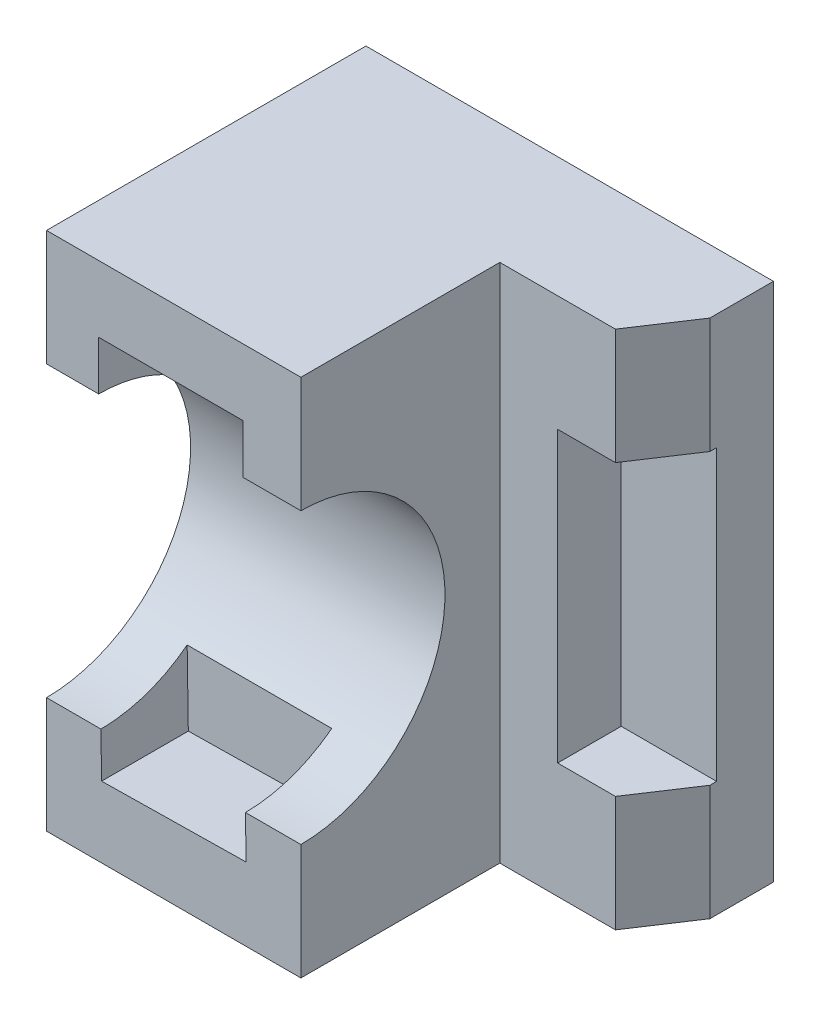
ISO-10303-21;
HEADER;
FILE_DESCRIPTION(('STEP AP214'),'2;1');
FILE_NAME('part.step','',(''),(''),'','','');
FILE_SCHEMA(('AUTOMOTIVE_DESIGN { 1 0 10303 214 1 1 1 1 }'));
ENDSEC;
DATA;
#1=APPLICATION_CONTEXT('core data for automotive mechanical design processes');
#2=APPLICATION_PROTOCOL_DEFINITION('international standard','automotive_design',2000,#1);
#3=PRODUCT_CONTEXT('',#1,'mechanical');
#4=PRODUCT('Part','Part','',(#3));
#5=PRODUCT_RELATED_PRODUCT_CATEGORY('part','',(#4));
#6=PRODUCT_DEFINITION_FORMATION('','',#4);
#7=PRODUCT_DEFINITION_CONTEXT('part definition',#1,'design');
#8=PRODUCT_DEFINITION('design','',#6,#7);
#9=PRODUCT_DEFINITION_SHAPE('','',#8);
#10=(LENGTH_UNIT() NAMED_UNIT(*) SI_UNIT(.MILLI.,.METRE.));
#11=(NAMED_UNIT(*) PLANE_ANGLE_UNIT() SI_UNIT($,.RADIAN.));
#12=(NAMED_UNIT(*) SI_UNIT($,.STERADIAN.) SOLID_ANGLE_UNIT());
#13=UNCERTAINTY_MEASURE_WITH_UNIT(LENGTH_MEASURE(1.E-05),#10,'distance_accuracy_value','');
#14=(GEOMETRIC_REPRESENTATION_CONTEXT(3) GLOBAL_UNCERTAINTY_ASSIGNED_CONTEXT((#13)) GLOBAL_UNIT_ASSIGNED_CONTEXT((#10,
#11,#12)) REPRESENTATION_CONTEXT('',''));
#15=CARTESIAN_POINT('',(0.,0.,0.));
#16=DIRECTION('',(0.,0.,1.));
#17=DIRECTION('',(1.,0.,0.));
#18=AXIS2_PLACEMENT_3D('',#15,#16,#17);
#19=CARTESIAN_POINT('',(35.25,45.,55.25));
#20=DIRECTION('',(-1.,0.,0.));
#21=DIRECTION('',(0.,-1.,0.));
#22=AXIS2_PLACEMENT_3D('',#19,#20,#21);
#23=PLANE('',#22);
#24=DIRECTION('',(0.,0.,-1.));
#25=VECTOR('',#24,1.);
#26=CARTESIAN_POINT('',(35.25,25.,55.25));
#27=LINE('',#26,#25);
#28=CARTESIAN_POINT('',(35.25,25.,11.));
#29=VERTEX_POINT('',#28);
#30=CARTESIAN_POINT('',(35.25,25.,9.83528129668615));
#31=VERTEX_POINT('',#30);
#32=EDGE_CURVE('E249',#29,#31,#27,.T.);
#33=ORIENTED_EDGE('',*,*,#32,.T.);
#34=DIRECTION('',(0.,1.,0.));
#35=VECTOR('',#34,1.);
#36=CARTESIAN_POINT('',(35.25,25.,9.83528129668615));
#37=LINE('',#36,#35);
#38=CARTESIAN_POINT('',(35.25,-25.,9.83528129668615));
#39=VERTEX_POINT('',#38);
#40=EDGE_CURVE('E214',#39,#31,#37,.T.);
#41=ORIENTED_EDGE('',*,*,#40,.F.);
#42=DIRECTION('',(0.,0.,-1.));
#43=VECTOR('',#42,1.);
#44=CARTESIAN_POINT('',(35.25,-25.,55.25));
#45=LINE('',#44,#43);
#46=CARTESIAN_POINT('',(35.25,-25.,11.));
#47=VERTEX_POINT('',#46);
#48=EDGE_CURVE('E243',#47,#39,#45,.T.);
#49=ORIENTED_EDGE('',*,*,#48,.F.);
#50=DIRECTION('',(0.,-1.,0.));
#51=VECTOR('',#50,1.);
#52=CARTESIAN_POINT('',(35.25,45.,11.));
#53=LINE('',#52,#51);
#54=CARTESIAN_POINT('',(35.25,-45.,11.));
#55=VERTEX_POINT('',#54);
#56=EDGE_CURVE('E293',#47,#55,#53,.T.);
#57=ORIENTED_EDGE('',*,*,#56,.T.);
#58=DIRECTION('',(0.,0.,-1.));
#59=VECTOR('',#58,1.);
#60=CARTESIAN_POINT('',(35.25,-45.,55.25));
#61=LINE('',#60,#59);
#62=CARTESIAN_POINT('',(35.25,-45.,0.));
#63=VERTEX_POINT('',#62);
#64=EDGE_CURVE('E309',#55,#63,#61,.T.);
#65=ORIENTED_EDGE('',*,*,#64,.T.);
#66=DIRECTION('',(0.,1.,0.));
#67=VECTOR('',#66,1.);
#68=CARTESIAN_POINT('',(35.25,45.,0.));
#69=LINE('',#68,#67);
#70=CARTESIAN_POINT('',(35.25,45.,0.));
#71=VERTEX_POINT('',#70);
#72=EDGE_CURVE('E288',#63,#71,#69,.T.);
#73=ORIENTED_EDGE('',*,*,#72,.T.);
#74=DIRECTION('',(0.,0.,-1.));
#75=VECTOR('',#74,1.);
#76=CARTESIAN_POINT('',(35.25,45.,55.25));
#77=LINE('',#76,#75);
#78=CARTESIAN_POINT('',(35.25,45.,11.));
#79=VERTEX_POINT('',#78);
#80=EDGE_CURVE('E325',#79,#71,#77,.T.);
#81=ORIENTED_EDGE('',*,*,#80,.F.);
#82=EDGE_CURVE('E290',#79,#29,#53,.T.);
#83=ORIENTED_EDGE('',*,*,#82,.T.);
#84=EDGE_LOOP('',(#33,#41,#49,#57,#65,#73,#81,#83));
#85=FACE_BOUND('',#84,.T.);
#86=ADVANCED_FACE('F37',(#85),#23,.F.);
#87=CARTESIAN_POINT('',(29.593975486219,45.,19.5582449406136));
#88=DIRECTION('',(0.834269415372969,0.,0.551357001019525));
#89=DIRECTION('',(0.551357001019525,0.,-0.834269415372969));
#90=AXIS2_PLACEMENT_3D('',#87,#88,#89);
#91=PLANE('',#90);
#92=DIRECTION('',(0.,-1.,0.));
#93=VECTOR('',#92,1.);
#94=CARTESIAN_POINT('',(28.75,45.,20.8352812966861));
#95=LINE('',#94,#93);
#96=CARTESIAN_POINT('',(28.75,45.,20.8352812966861));
#97=VERTEX_POINT('',#96);
#98=CARTESIAN_POINT('',(28.75,25.,20.8352812966861));
#99=VERTEX_POINT('',#98);
#100=EDGE_CURVE('E294',#97,#99,#95,.T.);
#101=ORIENTED_EDGE('',*,*,#100,.T.);
#102=DIRECTION('',(0.551357001019525,0.,-0.834269415372969));
#103=VECTOR('',#102,1.);
#104=CARTESIAN_POINT('',(29.593975486219,25.,19.5582449406136));
#105=LINE('',#104,#103);
#106=EDGE_CURVE('E255',#99,#29,#105,.T.);
#107=ORIENTED_EDGE('',*,*,#106,.T.);
#108=ORIENTED_EDGE('',*,*,#82,.F.);
#109=DIRECTION('',(-0.551357001019525,0.,0.834269415372969));
#110=VECTOR('',#109,1.);
#111=CARTESIAN_POINT('',(29.593975486219,45.,19.5582449406136));
#112=LINE('',#111,#110);
#113=EDGE_CURVE('E275',#79,#97,#112,.T.);
#114=ORIENTED_EDGE('',*,*,#113,.T.);
#115=EDGE_LOOP('',(#101,#107,#108,#114));
#116=FACE_BOUND('',#115,.T.);
#117=ADVANCED_FACE('F424',(#116),#91,.T.);
#118=ORIENTED_EDGE('',*,*,#56,.F.);
#119=DIRECTION('',(-0.551357001019525,0.,0.834269415372969));
#120=VECTOR('',#119,1.);
#121=CARTESIAN_POINT('',(29.593975486219,-25.,19.5582449406136));
#122=LINE('',#121,#120);
#123=CARTESIAN_POINT('',(28.75,-25.,20.8352812966861));
#124=VERTEX_POINT('',#123);
#125=EDGE_CURVE('E252',#47,#124,#122,.T.);
#126=ORIENTED_EDGE('',*,*,#125,.T.);
#127=CARTESIAN_POINT('',(28.75,-45.,20.8352812966861));
#128=VERTEX_POINT('',#127);
#129=EDGE_CURVE('E297',#124,#128,#95,.T.);
#130=ORIENTED_EDGE('',*,*,#129,.T.);
#131=DIRECTION('',(-0.551357001019525,0.,0.834269415372969));
#132=VECTOR('',#131,1.);
#133=CARTESIAN_POINT('',(29.593975486219,-45.,19.5582449406136));
#134=LINE('',#133,#132);
#135=EDGE_CURVE('E273',#55,#128,#134,.T.);
#136=ORIENTED_EDGE('',*,*,#135,.F.);
#137=EDGE_LOOP('',(#118,#126,#130,#136));
#138=FACE_BOUND('',#137,.T.);
#139=ADVANCED_FACE('F412',(#138),#91,.T.);
#140=CARTESIAN_POINT('',(0.,45.,20.8352812966861));
#141=DIRECTION('',(0.,0.,1.));
#142=DIRECTION('',(1.,0.,0.));
#143=AXIS2_PLACEMENT_3D('',#140,#141,#142);
#144=PLANE('',#143);
#145=DIRECTION('',(0.,1.,0.));
#146=VECTOR('',#145,1.);
#147=CARTESIAN_POINT('',(18.75,45.,20.8352812966861));
#148=LINE('',#147,#146);
#149=CARTESIAN_POINT('',(18.75,-25.,20.8352812966861));
#150=VERTEX_POINT('',#149);
#151=CARTESIAN_POINT('',(18.75,25.,20.8352812966862));
#152=VERTEX_POINT('',#151);
#153=EDGE_CURVE('E332',#150,#152,#148,.T.);
#154=ORIENTED_EDGE('',*,*,#153,.T.);
#155=DIRECTION('',(1.,0.,0.));
#156=VECTOR('',#155,1.);
#157=CARTESIAN_POINT('',(0.,25.,20.8352812966861));
#158=LINE('',#157,#156);
#159=EDGE_CURVE('E335',#152,#99,#158,.T.);
#160=ORIENTED_EDGE('',*,*,#159,.T.);
#161=ORIENTED_EDGE('',*,*,#100,.F.);
#162=DIRECTION('',(-1.,0.,0.));
#163=VECTOR('',#162,1.);
#164=CARTESIAN_POINT('',(0.,45.,20.8352812966861));
#165=LINE('',#164,#163);
#166=CARTESIAN_POINT('',(8.75000000000001,45.,20.8352812966861));
#167=VERTEX_POINT('',#166);
#168=EDGE_CURVE('E272',#97,#167,#165,.T.);
#169=ORIENTED_EDGE('',*,*,#168,.T.);
#170=DIRECTION('',(0.,-1.,0.));
#171=VECTOR('',#170,1.);
#172=CARTESIAN_POINT('',(8.75000000000001,45.,20.8352812966861));
#173=LINE('',#172,#171);
#174=CARTESIAN_POINT('',(8.75000000000001,-45.,20.8352812966861));
#175=VERTEX_POINT('',#174);
#176=EDGE_CURVE('E277',#167,#175,#173,.T.);
#177=ORIENTED_EDGE('',*,*,#176,.T.);
#178=DIRECTION('',(-1.,0.,0.));
#179=VECTOR('',#178,1.);
#180=CARTESIAN_POINT('',(0.,-45.,20.8352812966861));
#181=LINE('',#180,#179);
#182=EDGE_CURVE('E280',#128,#175,#181,.T.);
#183=ORIENTED_EDGE('',*,*,#182,.F.);
#184=ORIENTED_EDGE('',*,*,#129,.F.);
#185=DIRECTION('',(-1.,0.,0.));
#186=VECTOR('',#185,1.);
#187=CARTESIAN_POINT('',(0.,-25.,20.8352812966861));
#188=LINE('',#187,#186);
#189=EDGE_CURVE('E329',#124,#150,#188,.T.);
#190=ORIENTED_EDGE('',*,*,#189,.T.);
#191=EDGE_LOOP('',(#154,#160,#161,#169,#177,#183,#184,#190));
#192=FACE_BOUND('',#191,.T.);
#193=ADVANCED_FACE('F394',(#192),#144,.T.);
#194=CARTESIAN_POINT('',(0.,0.,55.25));
#195=DIRECTION('',(0.,0.,1.));
#196=DIRECTION('',(1.,0.,0.));
#197=AXIS2_PLACEMENT_3D('',#194,#195,#196);
#198=PLANE('',#197);
#199=DIRECTION('',(0.0153576422992211,-0.999882064457108,0.));
#200=VECTOR('',#199,1.);
#201=CARTESIAN_POINT('',(-25.7249479178134,-32.7489468110117,55.25));
#202=LINE('',#201,#200);
#203=CARTESIAN_POINT('',(-25.8439693545141,-24.9998797651539,55.25));
#204=VERTEX_POINT('',#203);
#205=CARTESIAN_POINT('',(-25.7249479178134,-32.7489468110117,55.25));
#206=VERTEX_POINT('',#205);
#207=EDGE_CURVE('E211',#204,#206,#202,.T.);
#208=ORIENTED_EDGE('',*,*,#207,.F.);
#209=DIRECTION('',(1.,0.,0.));
#210=VECTOR('',#209,1.);
#211=CARTESIAN_POINT('',(-35.25,-24.9998797651539,55.25));
#212=LINE('',#211,#210);
#213=CARTESIAN_POINT('',(-35.25,-24.9998797651539,55.25));
#214=VERTEX_POINT('',#213);
#215=EDGE_CURVE('E266',#214,#204,#212,.T.);
#216=ORIENTED_EDGE('',*,*,#215,.F.);
#217=DIRECTION('',(0.,-1.,0.));
#218=VECTOR('',#217,1.);
#219=CARTESIAN_POINT('',(-35.25,45.,55.25));
#220=LINE('',#219,#218);
#221=CARTESIAN_POINT('',(-35.25,-45.,55.25));
#222=VERTEX_POINT('',#221);
#223=EDGE_CURVE('E301',#214,#222,#220,.T.);
#224=ORIENTED_EDGE('',*,*,#223,.T.);
#225=DIRECTION('',(1.,0.,0.));
#226=VECTOR('',#225,1.);
#227=CARTESIAN_POINT('',(-35.25,-45.,55.25));
#228=LINE('',#227,#226);
#229=CARTESIAN_POINT('',(8.75000000000001,-45.,55.25));
#230=VERTEX_POINT('',#229);
#231=EDGE_CURVE('E306',#222,#230,#228,.T.);
#232=ORIENTED_EDGE('',*,*,#231,.T.);
#233=DIRECTION('',(0.,-1.,0.));
#234=VECTOR('',#233,1.);
#235=CARTESIAN_POINT('',(8.75000000000001,45.,55.25));
#236=LINE('',#235,#234);
#237=CARTESIAN_POINT('',(8.75000000000001,-24.9998797651539,55.25));
#238=VERTEX_POINT('',#237);
#239=EDGE_CURVE('E289',#238,#230,#236,.T.);
#240=ORIENTED_EDGE('',*,*,#239,.F.);
#241=CARTESIAN_POINT('',(-0.841020618180968,-24.9998797651539,55.25));
#242=VERTEX_POINT('',#241);
#243=EDGE_CURVE('E265',#242,#238,#212,.T.);
#244=ORIENTED_EDGE('',*,*,#243,.F.);
#245=DIRECTION('',(-0.015357642299222,0.999882064457108,0.));
#246=VECTOR('',#245,1.);
#247=CARTESIAN_POINT('',(-0.727896306385638,-32.3650057535312,55.25));
#248=LINE('',#247,#246);
#249=CARTESIAN_POINT('',(-0.727896306385638,-32.3650057535312,55.25));
#250=VERTEX_POINT('',#249);
#251=EDGE_CURVE('E221',#250,#242,#248,.T.);
#252=ORIENTED_EDGE('',*,*,#251,.F.);
#253=DIRECTION('',(0.999882064457108,0.0153576422992219,0.));
#254=VECTOR('',#253,1.);
#255=CARTESIAN_POINT('',(-25.7249479178134,-32.7489468110117,55.25));
#256=LINE('',#255,#254);
#257=EDGE_CURVE('E223',#206,#250,#256,.T.);
#258=ORIENTED_EDGE('',*,*,#257,.F.);
#259=EDGE_LOOP('',(#208,#216,#224,#232,#240,#244,#252,#258));
#260=FACE_BOUND('',#259,.T.);
#261=ADVANCED_FACE('F367',(#260),#198,.T.);
#262=CARTESIAN_POINT('',(-35.25,45.,55.25));
#263=DIRECTION('',(0.,-1.,0.));
#264=DIRECTION('',(0.,0.,-1.));
#265=AXIS2_PLACEMENT_3D('',#262,#263,#264);
#266=PLANE('',#265);
#267=DIRECTION('',(0.,0.,1.));
#268=VECTOR('',#267,1.);
#269=CARTESIAN_POINT('',(8.75000000000001,45.,0.));
#270=LINE('',#269,#268);
#271=CARTESIAN_POINT('',(8.75000000000001,45.,55.25));
#272=VERTEX_POINT('',#271);
#273=EDGE_CURVE('E270',#167,#272,#270,.T.);
#274=ORIENTED_EDGE('',*,*,#273,.F.);
#275=ORIENTED_EDGE('',*,*,#168,.F.);
#276=ORIENTED_EDGE('',*,*,#113,.F.);
#277=ORIENTED_EDGE('',*,*,#80,.T.);
#278=DIRECTION('',(-1.,0.,0.));
#279=VECTOR('',#278,1.);
#280=CARTESIAN_POINT('',(-35.25,45.,0.));
#281=LINE('',#280,#279);
#282=CARTESIAN_POINT('',(-35.25,45.,0.));
#283=VERTEX_POINT('',#282);
#284=EDGE_CURVE('E312',#71,#283,#281,.T.);
#285=ORIENTED_EDGE('',*,*,#284,.T.);
#286=DIRECTION('',(0.,0.,-1.));
#287=VECTOR('',#286,1.);
#288=CARTESIAN_POINT('',(-35.25,45.,55.25));
#289=LINE('',#288,#287);
#290=CARTESIAN_POINT('',(-35.25,45.,55.25));
#291=VERTEX_POINT('',#290);
#292=EDGE_CURVE('E322',#291,#283,#289,.T.);
#293=ORIENTED_EDGE('',*,*,#292,.F.);
#294=DIRECTION('',(-1.,0.,0.));
#295=VECTOR('',#294,1.);
#296=CARTESIAN_POINT('',(-35.25,45.,55.25));
#297=LINE('',#296,#295);
#298=EDGE_CURVE('E299',#272,#291,#297,.T.);
#299=ORIENTED_EDGE('',*,*,#298,.F.);
#300=EDGE_LOOP('',(#274,#275,#276,#277,#285,#293,#299));
#301=FACE_BOUND('',#300,.T.);
#302=ADVANCED_FACE('F399',(#301),#266,.F.);
#303=CARTESIAN_POINT('',(-35.25,-45.,55.25));
#304=DIRECTION('',(0.,1.,0.));
#305=DIRECTION('',(0.,0.,1.));
#306=AXIS2_PLACEMENT_3D('',#303,#304,#305);
#307=PLANE('',#306);
#308=DIRECTION('',(0.,0.,1.));
#309=VECTOR('',#308,1.);
#310=CARTESIAN_POINT('',(8.75000000000001,-45.,0.));
#311=LINE('',#310,#309);
#312=EDGE_CURVE('E269',#175,#230,#311,.T.);
#313=ORIENTED_EDGE('',*,*,#312,.T.);
#314=ORIENTED_EDGE('',*,*,#231,.F.);
#315=DIRECTION('',(0.,0.,-1.));
#316=VECTOR('',#315,1.);
#317=CARTESIAN_POINT('',(-35.25,-45.,55.25));
#318=LINE('',#317,#316);
#319=CARTESIAN_POINT('',(-35.25,-45.,0.));
#320=VERTEX_POINT('',#319);
#321=EDGE_CURVE('E319',#222,#320,#318,.T.);
#322=ORIENTED_EDGE('',*,*,#321,.T.);
#323=DIRECTION('',(1.,0.,0.));
#324=VECTOR('',#323,1.);
#325=CARTESIAN_POINT('',(-35.25,-45.,0.));
#326=LINE('',#325,#324);
#327=EDGE_CURVE('E302',#320,#63,#326,.T.);
#328=ORIENTED_EDGE('',*,*,#327,.T.);
#329=ORIENTED_EDGE('',*,*,#64,.F.);
#330=ORIENTED_EDGE('',*,*,#135,.T.);
#331=ORIENTED_EDGE('',*,*,#182,.T.);
#332=EDGE_LOOP('',(#313,#314,#322,#328,#329,#330,#331));
#333=FACE_BOUND('',#332,.T.);
#334=ADVANCED_FACE('F388',(#333),#307,.F.);
#335=DIRECTION('',(0.,1.,0.));
#336=VECTOR('',#335,1.);
#337=CARTESIAN_POINT('',(-1.23369173121415,33.5,55.25));
#338=LINE('',#337,#336);
#339=CARTESIAN_POINT('',(-1.23369173121414,24.9998797651539,55.25));
#340=VERTEX_POINT('',#339);
#341=CARTESIAN_POINT('',(-1.23369173121415,33.5,55.25));
#342=VERTEX_POINT('',#341);
#343=EDGE_CURVE('E199',#340,#342,#338,.T.);
#344=ORIENTED_EDGE('',*,*,#343,.F.);
#345=DIRECTION('',(1.,0.,0.));
#346=VECTOR('',#345,1.);
#347=CARTESIAN_POINT('',(-35.25,24.9998797651539,55.25));
#348=LINE('',#347,#346);
#349=CARTESIAN_POINT('',(8.75000000000001,24.9998797651539,55.25));
#350=VERTEX_POINT('',#349);
#351=EDGE_CURVE('E262',#350,#340,#348,.F.);
#352=ORIENTED_EDGE('',*,*,#351,.F.);
#353=EDGE_CURVE('E285',#272,#350,#236,.T.);
#354=ORIENTED_EDGE('',*,*,#353,.F.);
#355=ORIENTED_EDGE('',*,*,#298,.T.);
#356=CARTESIAN_POINT('',(-35.25,24.9998797651539,55.25));
#357=VERTEX_POINT('',#356);
#358=EDGE_CURVE('E303',#291,#357,#220,.T.);
#359=ORIENTED_EDGE('',*,*,#358,.T.);
#360=CARTESIAN_POINT('',(-26.2336917312141,24.9998797651539,55.25));
#361=VERTEX_POINT('',#360);
#362=EDGE_CURVE('E261',#361,#357,#348,.F.);
#363=ORIENTED_EDGE('',*,*,#362,.F.);
#364=DIRECTION('',(0.,-1.,0.));
#365=VECTOR('',#364,1.);
#366=CARTESIAN_POINT('',(-26.2336917312141,33.5,55.25));
#367=LINE('',#366,#365);
#368=CARTESIAN_POINT('',(-26.2336917312141,33.5,55.25));
#369=VERTEX_POINT('',#368);
#370=EDGE_CURVE('E193',#369,#361,#367,.T.);
#371=ORIENTED_EDGE('',*,*,#370,.F.);
#372=DIRECTION('',(-1.,0.,0.));
#373=VECTOR('',#372,1.);
#374=CARTESIAN_POINT('',(-26.2336917312141,33.5,55.25));
#375=LINE('',#374,#373);
#376=EDGE_CURVE('E210',#342,#369,#375,.T.);
#377=ORIENTED_EDGE('',*,*,#376,.F.);
#378=EDGE_LOOP('',(#344,#352,#354,#355,#359,#363,#371,#377));
#379=FACE_BOUND('',#378,.T.);
#380=ADVANCED_FACE('F354',(#379),#198,.T.);
#381=CARTESIAN_POINT('',(-35.25,45.,55.25));
#382=DIRECTION('',(1.,0.,0.));
#383=DIRECTION('',(0.,1.,0.));
#384=AXIS2_PLACEMENT_3D('',#381,#382,#383);
#385=PLANE('',#384);
#386=ORIENTED_EDGE('',*,*,#223,.F.);
#387=CARTESIAN_POINT('',(-35.25,0.,55.3275353329181));
#388=DIRECTION('',(1.,0.,0.));
#389=DIRECTION('',(0.,0.,-1.));
#390=AXIS2_PLACEMENT_3D('',#387,#388,#389);
#391=CIRCLE('',#390,25.);
#392=EDGE_CURVE('E258',#214,#357,#391,.T.);
#393=ORIENTED_EDGE('',*,*,#392,.T.);
#394=ORIENTED_EDGE('',*,*,#358,.F.);
#395=ORIENTED_EDGE('',*,*,#292,.T.);
#396=DIRECTION('',(0.,-1.,0.));
#397=VECTOR('',#396,1.);
#398=CARTESIAN_POINT('',(-35.25,45.,0.));
#399=LINE('',#398,#397);
#400=EDGE_CURVE('E314',#283,#320,#399,.T.);
#401=ORIENTED_EDGE('',*,*,#400,.T.);
#402=ORIENTED_EDGE('',*,*,#321,.F.);
#403=EDGE_LOOP('',(#386,#393,#394,#395,#401,#402));
#404=FACE_BOUND('',#403,.T.);
#405=ADVANCED_FACE('F361',(#404),#385,.F.);
#406=CARTESIAN_POINT('',(0.,0.,0.));
#407=DIRECTION('',(0.,0.,1.));
#408=DIRECTION('',(1.,0.,0.));
#409=AXIS2_PLACEMENT_3D('',#406,#407,#408);
#410=PLANE('',#409);
#411=ORIENTED_EDGE('',*,*,#72,.F.);
#412=ORIENTED_EDGE('',*,*,#327,.F.);
#413=ORIENTED_EDGE('',*,*,#400,.F.);
#414=ORIENTED_EDGE('',*,*,#284,.F.);
#415=EDGE_LOOP('',(#411,#412,#413,#414));
#416=FACE_BOUND('',#415,.T.);
#417=ADVANCED_FACE('F405',(#416),#410,.F.);
#418=CARTESIAN_POINT('',(8.75000000000001,45.,0.));
#419=DIRECTION('',(1.,0.,0.));
#420=DIRECTION('',(0.,0.,-1.));
#421=AXIS2_PLACEMENT_3D('',#418,#419,#420);
#422=PLANE('',#421);
#423=CARTESIAN_POINT('',(8.75000000000001,0.,55.3275353329181));
#424=DIRECTION('',(1.,0.,0.));
#425=DIRECTION('',(0.,0.,-1.));
#426=AXIS2_PLACEMENT_3D('',#423,#424,#425);
#427=CIRCLE('',#426,25.);
#428=EDGE_CURVE('E327',#238,#350,#427,.T.);
#429=ORIENTED_EDGE('',*,*,#428,.F.);
#430=ORIENTED_EDGE('',*,*,#239,.T.);
#431=ORIENTED_EDGE('',*,*,#312,.F.);
#432=ORIENTED_EDGE('',*,*,#176,.F.);
#433=ORIENTED_EDGE('',*,*,#273,.T.);
#434=ORIENTED_EDGE('',*,*,#353,.T.);
#435=EDGE_LOOP('',(#429,#430,#431,#432,#433,#434));
#436=FACE_BOUND('',#435,.T.);
#437=ADVANCED_FACE('F385',(#436),#422,.T.);
#438=CARTESIAN_POINT('',(-35.25,0.,55.3275353329181));
#439=DIRECTION('',(1.,0.,0.));
#440=DIRECTION('',(0.,0.,-1.));
#441=AXIS2_PLACEMENT_3D('',#438,#439,#440);
#442=CYLINDRICAL_SURFACE('',#441,25.);
#443=ORIENTED_EDGE('',*,*,#351,.T.);
#444=CARTESIAN_POINT('',(-1.23369173121414,0.,55.3275353329181));
#445=DIRECTION('',(1.,0.,0.));
#446=DIRECTION('',(0.,1.,0.));
#447=AXIS2_PLACEMENT_3D('',#444,#445,#446);
#448=CIRCLE('',#447,25.);
#449=CARTESIAN_POINT('',(-1.23369173121414,19.9416129810155,40.25));
#450=VERTEX_POINT('',#449);
#451=EDGE_CURVE('E11',#340,#450,#448,.F.);
#452=ORIENTED_EDGE('',*,*,#451,.T.);
#453=DIRECTION('',(1.,0.,0.));
#454=VECTOR('',#453,1.);
#455=CARTESIAN_POINT('',(-35.25,19.9416129810155,40.25));
#456=LINE('',#455,#454);
#457=CARTESIAN_POINT('',(-26.2336917312141,19.9416129810155,40.25));
#458=VERTEX_POINT('',#457);
#459=EDGE_CURVE('E191',#458,#450,#456,.T.);
#460=ORIENTED_EDGE('',*,*,#459,.F.);
#461=CARTESIAN_POINT('',(-26.2336917312141,0.,55.3275353329181));
#462=DIRECTION('',(-1.,0.,0.));
#463=DIRECTION('',(0.,-1.,0.));
#464=AXIS2_PLACEMENT_3D('',#461,#462,#463);
#465=CIRCLE('',#464,25.);
#466=EDGE_CURVE('E44',#458,#361,#465,.F.);
#467=ORIENTED_EDGE('',*,*,#466,.T.);
#468=ORIENTED_EDGE('',*,*,#362,.T.);
#469=ORIENTED_EDGE('',*,*,#392,.F.);
#470=ORIENTED_EDGE('',*,*,#215,.T.);
#471=CARTESIAN_POINT('',(-26.2279538508909,0.,55.3275353329181));
#472=DIRECTION('',(-0.999882064457108,-0.0153576422992211,0.));
#473=DIRECTION('',(0.0153576422992211,-0.999882064457108,0.));
#474=AXIS2_PLACEMENT_3D('',#471,#472,#473);
#475=ELLIPSE('',#474,25.0029487363331,25.);
#476=CARTESIAN_POINT('',(-25.9216615691124,-19.9416129810155,40.25));
#477=VERTEX_POINT('',#476);
#478=EDGE_CURVE('E344',#204,#477,#475,.F.);
#479=ORIENTED_EDGE('',*,*,#478,.T.);
#480=DIRECTION('',(1.,0.,0.));
#481=VECTOR('',#480,1.);
#482=CARTESIAN_POINT('',(-35.25,-19.9416129810155,40.25));
#483=LINE('',#482,#481);
#484=CARTESIAN_POINT('',(-0.918712832779306,-19.9416129810155,40.25));
#485=VERTEX_POINT('',#484);
#486=EDGE_CURVE('E338',#477,#485,#483,.T.);
#487=ORIENTED_EDGE('',*,*,#486,.T.);
#488=CARTESIAN_POINT('',(-1.2250051145578,0.,55.3275353329181));
#489=DIRECTION('',(0.999882064457108,0.015357642299222,0.));
#490=DIRECTION('',(0.015357642299222,-0.999882064457108,0.));
#491=AXIS2_PLACEMENT_3D('',#488,#489,#490);
#492=ELLIPSE('',#491,25.0029487363331,25.);
#493=EDGE_CURVE('E341',#485,#242,#492,.F.);
#494=ORIENTED_EDGE('',*,*,#493,.T.);
#495=ORIENTED_EDGE('',*,*,#243,.T.);
#496=ORIENTED_EDGE('',*,*,#428,.T.);
#497=EDGE_LOOP('',(#443,#452,#460,#467,#468,#469,#470,#479,#487,#494,#495,#496));
#498=FACE_BOUND('',#497,.T.);
#499=ADVANCED_FACE('F350',(#498),#442,.F.);
#500=CARTESIAN_POINT('',(18.75,25.,55.25));
#501=DIRECTION('',(0.,-1.,0.));
#502=DIRECTION('',(1.,0.,0.));
#503=AXIS2_PLACEMENT_3D('',#500,#501,#502);
#504=PLANE('',#503);
#505=ORIENTED_EDGE('',*,*,#159,.F.);
#506=DIRECTION('',(0.,0.,-1.));
#507=VECTOR('',#506,1.);
#508=CARTESIAN_POINT('',(18.75,25.,55.25));
#509=LINE('',#508,#507);
#510=CARTESIAN_POINT('',(18.75,25.,9.83528129668615));
#511=VERTEX_POINT('',#510);
#512=EDGE_CURVE('E247',#152,#511,#509,.T.);
#513=ORIENTED_EDGE('',*,*,#512,.T.);
#514=DIRECTION('',(-1.,0.,0.));
#515=VECTOR('',#514,1.);
#516=CARTESIAN_POINT('',(18.75,25.,9.83528129668615));
#517=LINE('',#516,#515);
#518=EDGE_CURVE('E234',#31,#511,#517,.T.);
#519=ORIENTED_EDGE('',*,*,#518,.F.);
#520=ORIENTED_EDGE('',*,*,#32,.F.);
#521=ORIENTED_EDGE('',*,*,#106,.F.);
#522=EDGE_LOOP('',(#505,#513,#519,#520,#521));
#523=FACE_BOUND('',#522,.T.);
#524=ADVANCED_FACE('F422',(#523),#504,.T.);
#525=CARTESIAN_POINT('',(18.75,25.,55.25));
#526=DIRECTION('',(1.,0.,0.));
#527=DIRECTION('',(0.,1.,0.));
#528=AXIS2_PLACEMENT_3D('',#525,#526,#527);
#529=PLANE('',#528);
#530=DIRECTION('',(0.,0.,-1.));
#531=VECTOR('',#530,1.);
#532=CARTESIAN_POINT('',(18.75,-25.,55.25));
#533=LINE('',#532,#531);
#534=CARTESIAN_POINT('',(18.75,-25.,9.83528129668615));
#535=VERTEX_POINT('',#534);
#536=EDGE_CURVE('E245',#150,#535,#533,.T.);
#537=ORIENTED_EDGE('',*,*,#536,.T.);
#538=DIRECTION('',(0.,-1.,0.));
#539=VECTOR('',#538,1.);
#540=CARTESIAN_POINT('',(18.75,25.,9.83528129668615));
#541=LINE('',#540,#539);
#542=EDGE_CURVE('E237',#511,#535,#541,.T.);
#543=ORIENTED_EDGE('',*,*,#542,.F.);
#544=ORIENTED_EDGE('',*,*,#512,.F.);
#545=ORIENTED_EDGE('',*,*,#153,.F.);
#546=EDGE_LOOP('',(#537,#543,#544,#545));
#547=FACE_BOUND('',#546,.T.);
#548=ADVANCED_FACE('F419',(#547),#529,.T.);
#549=CARTESIAN_POINT('',(18.75,-25.,55.25));
#550=DIRECTION('',(0.,1.,0.));
#551=DIRECTION('',(-1.,0.,0.));
#552=AXIS2_PLACEMENT_3D('',#549,#550,#551);
#553=PLANE('',#552);
#554=ORIENTED_EDGE('',*,*,#48,.T.);
#555=DIRECTION('',(1.,0.,0.));
#556=VECTOR('',#555,1.);
#557=CARTESIAN_POINT('',(18.75,-25.,9.83528129668615));
#558=LINE('',#557,#556);
#559=EDGE_CURVE('E240',#535,#39,#558,.T.);
#560=ORIENTED_EDGE('',*,*,#559,.F.);
#561=ORIENTED_EDGE('',*,*,#536,.F.);
#562=ORIENTED_EDGE('',*,*,#189,.F.);
#563=ORIENTED_EDGE('',*,*,#125,.F.);
#564=EDGE_LOOP('',(#554,#560,#561,#562,#563));
#565=FACE_BOUND('',#564,.T.);
#566=ADVANCED_FACE('F414',(#565),#553,.T.);
#567=CARTESIAN_POINT('',(0.,0.,9.83528129668615));
#568=DIRECTION('',(0.,0.,1.));
#569=DIRECTION('',(1.,0.,0.));
#570=AXIS2_PLACEMENT_3D('',#567,#568,#569);
#571=PLANE('',#570);
#572=ORIENTED_EDGE('',*,*,#40,.T.);
#573=ORIENTED_EDGE('',*,*,#518,.T.);
#574=ORIENTED_EDGE('',*,*,#542,.T.);
#575=ORIENTED_EDGE('',*,*,#559,.T.);
#576=EDGE_LOOP('',(#572,#573,#574,#575));
#577=FACE_BOUND('',#576,.T.);
#578=ADVANCED_FACE('F426',(#577),#571,.T.);
#579=CARTESIAN_POINT('',(-25.7249479178134,-32.7489468110117,40.25));
#580=DIRECTION('',(-0.999882064457108,-0.0153576422992211,0.));
#581=DIRECTION('',(0.0153576422992211,-0.999882064457108,0.));
#582=AXIS2_PLACEMENT_3D('',#579,#580,#581);
#583=PLANE('',#582);
#584=ORIENTED_EDGE('',*,*,#207,.T.);
#585=DIRECTION('',(0.,0.,1.));
#586=VECTOR('',#585,1.);
#587=CARTESIAN_POINT('',(-25.7249479178134,-32.7489468110117,40.25));
#588=LINE('',#587,#586);
#589=CARTESIAN_POINT('',(-25.7249479178134,-32.7489468110117,40.25));
#590=VERTEX_POINT('',#589);
#591=EDGE_CURVE('E216',#590,#206,#588,.T.);
#592=ORIENTED_EDGE('',*,*,#591,.F.);
#593=DIRECTION('',(0.0153576422992211,-0.999882064457108,0.));
#594=VECTOR('',#593,1.);
#595=CARTESIAN_POINT('',(-25.7249479178134,-32.7489468110117,40.25));
#596=LINE('',#595,#594);
#597=EDGE_CURVE('E224',#477,#590,#596,.T.);
#598=ORIENTED_EDGE('',*,*,#597,.F.);
#599=ORIENTED_EDGE('',*,*,#478,.F.);
#600=EDGE_LOOP('',(#584,#592,#598,#599));
#601=FACE_BOUND('',#600,.T.);
#602=ADVANCED_FACE('F372',(#601),#583,.F.);
#603=CARTESIAN_POINT('',(-0.727896306385638,-32.3650057535312,40.25));
#604=DIRECTION('',(0.999882064457108,0.015357642299222,0.));
#605=DIRECTION('',(-0.015357642299222,0.999882064457108,0.));
#606=AXIS2_PLACEMENT_3D('',#603,#604,#605);
#607=PLANE('',#606);
#608=DIRECTION('',(-0.015357642299222,0.999882064457108,0.));
#609=VECTOR('',#608,1.);
#610=CARTESIAN_POINT('',(-0.727896306385638,-32.3650057535312,40.25));
#611=LINE('',#610,#609);
#612=CARTESIAN_POINT('',(-0.727896306385638,-32.3650057535312,40.25));
#613=VERTEX_POINT('',#612);
#614=EDGE_CURVE('E59',#613,#485,#611,.T.);
#615=ORIENTED_EDGE('',*,*,#614,.F.);
#616=DIRECTION('',(0.,0.,1.));
#617=VECTOR('',#616,1.);
#618=CARTESIAN_POINT('',(-0.727896306385638,-32.3650057535312,40.25));
#619=LINE('',#618,#617);
#620=EDGE_CURVE('E219',#613,#250,#619,.T.);
#621=ORIENTED_EDGE('',*,*,#620,.T.);
#622=ORIENTED_EDGE('',*,*,#251,.T.);
#623=ORIENTED_EDGE('',*,*,#493,.F.);
#624=EDGE_LOOP('',(#615,#621,#622,#623));
#625=FACE_BOUND('',#624,.T.);
#626=ADVANCED_FACE('F433',(#625),#607,.F.);
#627=CARTESIAN_POINT('',(0.,0.,40.25));
#628=DIRECTION('',(0.,0.,-1.));
#629=DIRECTION('',(-1.,0.,0.));
#630=AXIS2_PLACEMENT_3D('',#627,#628,#629);
#631=PLANE('',#630);
#632=ORIENTED_EDGE('',*,*,#597,.T.);
#633=DIRECTION('',(0.999882064457108,0.0153576422992219,0.));
#634=VECTOR('',#633,1.);
#635=CARTESIAN_POINT('',(-25.7249479178134,-32.7489468110117,40.25));
#636=LINE('',#635,#634);
#637=EDGE_CURVE('E229',#590,#613,#636,.T.);
#638=ORIENTED_EDGE('',*,*,#637,.T.);
#639=ORIENTED_EDGE('',*,*,#614,.T.);
#640=ORIENTED_EDGE('',*,*,#486,.F.);
#641=EDGE_LOOP('',(#632,#638,#639,#640));
#642=FACE_BOUND('',#641,.T.);
#643=ADVANCED_FACE('F377',(#642),#631,.F.);
#644=CARTESIAN_POINT('',(-25.7249479178134,-32.7489468110117,40.25));
#645=DIRECTION('',(0.0153576422992219,-0.999882064457108,0.));
#646=DIRECTION('',(0.999882064457108,0.0153576422992219,0.));
#647=AXIS2_PLACEMENT_3D('',#644,#645,#646);
#648=PLANE('',#647);
#649=ORIENTED_EDGE('',*,*,#257,.T.);
#650=ORIENTED_EDGE('',*,*,#620,.F.);
#651=ORIENTED_EDGE('',*,*,#637,.F.);
#652=ORIENTED_EDGE('',*,*,#591,.T.);
#653=EDGE_LOOP('',(#649,#650,#651,#652));
#654=FACE_BOUND('',#653,.T.);
#655=ADVANCED_FACE('F376',(#654),#648,.F.);
#656=CARTESIAN_POINT('',(-1.23369173121415,33.5,40.25));
#657=DIRECTION('',(1.,0.,0.));
#658=DIRECTION('',(0.,1.,0.));
#659=AXIS2_PLACEMENT_3D('',#656,#657,#658);
#660=PLANE('',#659);
#661=ORIENTED_EDGE('',*,*,#343,.T.);
#662=DIRECTION('',(0.,0.,1.));
#663=VECTOR('',#662,1.);
#664=CARTESIAN_POINT('',(-1.23369173121415,33.5,40.25));
#665=LINE('',#664,#663);
#666=CARTESIAN_POINT('',(-1.23369173121415,33.5,40.25));
#667=VERTEX_POINT('',#666);
#668=EDGE_CURVE('E196',#667,#342,#665,.T.);
#669=ORIENTED_EDGE('',*,*,#668,.F.);
#670=DIRECTION('',(0.,1.,0.));
#671=VECTOR('',#670,1.);
#672=CARTESIAN_POINT('',(-1.23369173121415,33.5,40.25));
#673=LINE('',#672,#671);
#674=EDGE_CURVE('E185',#450,#667,#673,.T.);
#675=ORIENTED_EDGE('',*,*,#674,.F.);
#676=ORIENTED_EDGE('',*,*,#451,.F.);
#677=EDGE_LOOP('',(#661,#669,#675,#676));
#678=FACE_BOUND('',#677,.T.);
#679=ADVANCED_FACE('F197',(#678),#660,.F.);
#680=CARTESIAN_POINT('',(-26.2336917312141,33.5,40.25));
#681=DIRECTION('',(-1.,0.,0.));
#682=DIRECTION('',(0.,-1.,0.));
#683=AXIS2_PLACEMENT_3D('',#680,#681,#682);
#684=PLANE('',#683);
#685=DIRECTION('',(0.,-1.,0.));
#686=VECTOR('',#685,1.);
#687=CARTESIAN_POINT('',(-26.2336917312141,33.5,40.25));
#688=LINE('',#687,#686);
#689=CARTESIAN_POINT('',(-26.2336917312141,33.5,40.25));
#690=VERTEX_POINT('',#689);
#691=EDGE_CURVE('E51',#690,#458,#688,.T.);
#692=ORIENTED_EDGE('',*,*,#691,.F.);
#693=DIRECTION('',(0.,0.,1.));
#694=VECTOR('',#693,1.);
#695=CARTESIAN_POINT('',(-26.2336917312141,33.5,40.25));
#696=LINE('',#695,#694);
#697=EDGE_CURVE('E203',#690,#369,#696,.T.);
#698=ORIENTED_EDGE('',*,*,#697,.T.);
#699=ORIENTED_EDGE('',*,*,#370,.T.);
#700=ORIENTED_EDGE('',*,*,#466,.F.);
#701=EDGE_LOOP('',(#692,#698,#699,#700));
#702=FACE_BOUND('',#701,.T.);
#703=ADVANCED_FACE('F581',(#702),#684,.F.);
#704=CARTESIAN_POINT('',(0.,0.,40.25));
#705=DIRECTION('',(0.,0.,1.));
#706=DIRECTION('',(1.,0.,0.));
#707=AXIS2_PLACEMENT_3D('',#704,#705,#706);
#708=PLANE('',#707);
#709=ORIENTED_EDGE('',*,*,#459,.T.);
#710=ORIENTED_EDGE('',*,*,#674,.T.);
#711=DIRECTION('',(-1.,0.,0.));
#712=VECTOR('',#711,1.);
#713=CARTESIAN_POINT('',(-26.2336917312141,33.5,40.25));
#714=LINE('',#713,#712);
#715=EDGE_CURVE('E189',#667,#690,#714,.T.);
#716=ORIENTED_EDGE('',*,*,#715,.T.);
#717=ORIENTED_EDGE('',*,*,#691,.T.);
#718=EDGE_LOOP('',(#709,#710,#716,#717));
#719=FACE_BOUND('',#718,.T.);
#720=ADVANCED_FACE('F187',(#719),#708,.T.);
#721=CARTESIAN_POINT('',(-26.2336917312141,33.5,40.25));
#722=DIRECTION('',(0.,1.,0.));
#723=DIRECTION('',(0.,0.,1.));
#724=AXIS2_PLACEMENT_3D('',#721,#722,#723);
#725=PLANE('',#724);
#726=ORIENTED_EDGE('',*,*,#376,.T.);
#727=ORIENTED_EDGE('',*,*,#697,.F.);
#728=ORIENTED_EDGE('',*,*,#715,.F.);
#729=ORIENTED_EDGE('',*,*,#668,.T.);
#730=EDGE_LOOP('',(#726,#727,#728,#729));
#731=FACE_BOUND('',#730,.T.);
#732=ADVANCED_FACE('F205',(#731),#725,.F.);
#733=CLOSED_SHELL('',(#86,#117,#139,#193,#261,#302,#334,#380,#405,#417,#437,#499,#524,#548,#566,
#578,#602,#626,#643,#655,#679,#703,#720,#732));
#734=MANIFOLD_SOLID_BREP('B2',#733);
#735=ADVANCED_BREP_SHAPE_REPRESENTATION('',(#18,#734),#14);
#736=SHAPE_DEFINITION_REPRESENTATION(#9,#735);
ENDSEC;
END-ISO-10303-21;
